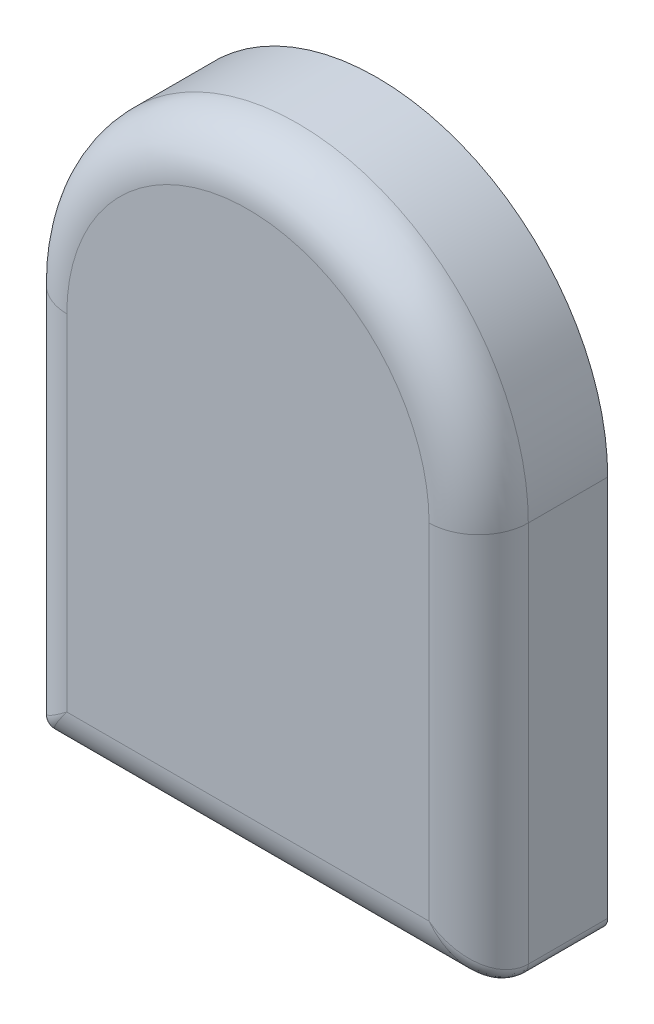
ISO-10303-21;
HEADER;
FILE_DESCRIPTION(('STEP AP214'),'2;1');
FILE_NAME('part.step','',(''),(''),'','','');
FILE_SCHEMA(('AUTOMOTIVE_DESIGN { 1 0 10303 214 1 1 1 1 }'));
ENDSEC;
DATA;
#1=APPLICATION_CONTEXT('core data for automotive mechanical design processes');
#2=APPLICATION_PROTOCOL_DEFINITION('international standard','automotive_design',2000,#1);
#3=PRODUCT_CONTEXT('',#1,'mechanical');
#4=PRODUCT('Part','Part','',(#3));
#5=PRODUCT_RELATED_PRODUCT_CATEGORY('part','',(#4));
#6=PRODUCT_DEFINITION_FORMATION('','',#4);
#7=PRODUCT_DEFINITION_CONTEXT('part definition',#1,'design');
#8=PRODUCT_DEFINITION('design','',#6,#7);
#9=PRODUCT_DEFINITION_SHAPE('','',#8);
#10=(LENGTH_UNIT() NAMED_UNIT(*) SI_UNIT(.MILLI.,.METRE.));
#11=(NAMED_UNIT(*) PLANE_ANGLE_UNIT() SI_UNIT($,.RADIAN.));
#12=(NAMED_UNIT(*) SI_UNIT($,.STERADIAN.) SOLID_ANGLE_UNIT());
#13=UNCERTAINTY_MEASURE_WITH_UNIT(LENGTH_MEASURE(1.E-05),#10,'distance_accuracy_value','');
#14=(GEOMETRIC_REPRESENTATION_CONTEXT(3) GLOBAL_UNCERTAINTY_ASSIGNED_CONTEXT((#13)) GLOBAL_UNIT_ASSIGNED_CONTEXT((#10,
#11,#12)) REPRESENTATION_CONTEXT('',''));
#15=CARTESIAN_POINT('',(0.,0.,0.));
#16=DIRECTION('',(0.,0.,1.));
#17=DIRECTION('',(1.,0.,0.));
#18=AXIS2_PLACEMENT_3D('',#15,#16,#17);
#19=CARTESIAN_POINT('',(8.8,-12.1,5.2));
#20=DIRECTION('',(0.,0.,-1.));
#21=DIRECTION('',(-1.,0.,0.));
#22=AXIS2_PLACEMENT_3D('',#19,#20,#21);
#23=CYLINDRICAL_SURFACE('',#22,0.5);
#24=DIRECTION('',(0.,0.,-1.));
#25=VECTOR('',#24,1.);
#26=CARTESIAN_POINT('',(9.3,-12.1,5.2));
#27=LINE('',#26,#25);
#28=CARTESIAN_POINT('',(9.3,-12.1,3.2));
#29=VERTEX_POINT('',#28);
#30=CARTESIAN_POINT('',(9.3,-12.1,0.));
#31=VERTEX_POINT('',#30);
#32=EDGE_CURVE('E109',#29,#31,#27,.T.);
#33=ORIENTED_EDGE('',*,*,#32,.F.);
#34=CARTESIAN_POINT('',(8.8,-12.1,3.2));
#35=DIRECTION('',(0.,0.,-1.));
#36=DIRECTION('',(-1.,0.,0.));
#37=AXIS2_PLACEMENT_3D('',#34,#35,#36);
#38=CIRCLE('',#37,0.5);
#39=CARTESIAN_POINT('',(8.8,-12.6,3.2));
#40=VERTEX_POINT('',#39);
#41=EDGE_CURVE('E185',#29,#40,#38,.T.);
#42=ORIENTED_EDGE('',*,*,#41,.T.);
#43=DIRECTION('',(0.,0.,-1.));
#44=VECTOR('',#43,1.);
#45=CARTESIAN_POINT('',(8.8,-12.6,5.2));
#46=LINE('',#45,#44);
#47=CARTESIAN_POINT('',(8.8,-12.6,0.));
#48=VERTEX_POINT('',#47);
#49=EDGE_CURVE('E135',#40,#48,#46,.T.);
#50=ORIENTED_EDGE('',*,*,#49,.T.);
#51=CARTESIAN_POINT('',(8.8,-12.1,0.));
#52=DIRECTION('',(0.,0.,1.));
#53=DIRECTION('',(1.,0.,0.));
#54=AXIS2_PLACEMENT_3D('',#51,#52,#53);
#55=CIRCLE('',#54,0.5);
#56=EDGE_CURVE('E128',#48,#31,#55,.T.);
#57=ORIENTED_EDGE('',*,*,#56,.T.);
#58=EDGE_LOOP('',(#33,#42,#50,#57));
#59=FACE_BOUND('',#58,.T.);
#60=ADVANCED_FACE('F43',(#59),#23,.T.);
#61=CARTESIAN_POINT('',(9.3,3.3,5.2));
#62=DIRECTION('',(-1.,0.,0.));
#63=DIRECTION('',(0.,0.,1.));
#64=AXIS2_PLACEMENT_3D('',#61,#62,#63);
#65=PLANE('',#64);
#66=DIRECTION('',(0.,0.,-1.));
#67=VECTOR('',#66,1.);
#68=CARTESIAN_POINT('',(9.3,3.3,5.2));
#69=LINE('',#68,#67);
#70=CARTESIAN_POINT('',(9.3,3.3,3.2));
#71=VERTEX_POINT('',#70);
#72=CARTESIAN_POINT('',(9.3,3.3,0.));
#73=VERTEX_POINT('',#72);
#74=EDGE_CURVE('E122',#71,#73,#69,.T.);
#75=ORIENTED_EDGE('',*,*,#74,.F.);
#76=DIRECTION('',(0.,1.,0.));
#77=VECTOR('',#76,1.);
#78=CARTESIAN_POINT('',(9.3,-12.1,3.2));
#79=LINE('',#78,#77);
#80=EDGE_CURVE('E116',#71,#29,#79,.F.);
#81=ORIENTED_EDGE('',*,*,#80,.T.);
#82=ORIENTED_EDGE('',*,*,#32,.T.);
#83=DIRECTION('',(0.,1.,0.));
#84=VECTOR('',#83,1.);
#85=CARTESIAN_POINT('',(9.3,3.3,0.));
#86=LINE('',#85,#84);
#87=EDGE_CURVE('E113',#31,#73,#86,.T.);
#88=ORIENTED_EDGE('',*,*,#87,.T.);
#89=EDGE_LOOP('',(#75,#81,#82,#88));
#90=FACE_BOUND('',#89,.T.);
#91=ADVANCED_FACE('F112',(#90),#65,.F.);
#92=CARTESIAN_POINT('',(0.,3.3,5.2));
#93=DIRECTION('',(0.,0.,-1.));
#94=DIRECTION('',(-1.,0.,0.));
#95=AXIS2_PLACEMENT_3D('',#92,#93,#94);
#96=CYLINDRICAL_SURFACE('',#95,9.3);
#97=DIRECTION('',(0.,0.,-1.));
#98=VECTOR('',#97,1.);
#99=CARTESIAN_POINT('',(-9.3,3.3,5.2));
#100=LINE('',#99,#98);
#101=CARTESIAN_POINT('',(-9.3,3.3,3.2));
#102=VERTEX_POINT('',#101);
#103=CARTESIAN_POINT('',(-9.3,3.3,0.));
#104=VERTEX_POINT('',#103);
#105=EDGE_CURVE('E164',#102,#104,#100,.T.);
#106=ORIENTED_EDGE('',*,*,#105,.F.);
#107=CARTESIAN_POINT('',(0.,3.3,3.2));
#108=DIRECTION('',(0.,0.,1.));
#109=DIRECTION('',(1.,0.,0.));
#110=AXIS2_PLACEMENT_3D('',#107,#108,#109);
#111=CIRCLE('',#110,9.3);
#112=EDGE_CURVE('E190',#102,#71,#111,.F.);
#113=ORIENTED_EDGE('',*,*,#112,.T.);
#114=ORIENTED_EDGE('',*,*,#74,.T.);
#115=CARTESIAN_POINT('',(0.,3.3,0.));
#116=DIRECTION('',(0.,0.,1.));
#117=DIRECTION('',(1.,0.,0.));
#118=AXIS2_PLACEMENT_3D('',#115,#116,#117);
#119=CIRCLE('',#118,9.3);
#120=EDGE_CURVE('E131',#73,#104,#119,.T.);
#121=ORIENTED_EDGE('',*,*,#120,.T.);
#122=EDGE_LOOP('',(#106,#113,#114,#121));
#123=FACE_BOUND('',#122,.T.);
#124=ADVANCED_FACE('F249',(#123),#96,.T.);
#125=CARTESIAN_POINT('',(-9.3,-12.1,5.2));
#126=DIRECTION('',(1.,0.,0.));
#127=DIRECTION('',(0.,1.,0.));
#128=AXIS2_PLACEMENT_3D('',#125,#126,#127);
#129=PLANE('',#128);
#130=DIRECTION('',(0.,0.,-1.));
#131=VECTOR('',#130,1.);
#132=CARTESIAN_POINT('',(-9.3,-12.1,5.2));
#133=LINE('',#132,#131);
#134=CARTESIAN_POINT('',(-9.3,-12.1,3.2));
#135=VERTEX_POINT('',#134);
#136=CARTESIAN_POINT('',(-9.3,-12.1,0.));
#137=VERTEX_POINT('',#136);
#138=EDGE_CURVE('E161',#135,#137,#133,.T.);
#139=ORIENTED_EDGE('',*,*,#138,.F.);
#140=DIRECTION('',(0.,-1.,0.));
#141=VECTOR('',#140,1.);
#142=CARTESIAN_POINT('',(-9.3,3.3,3.2));
#143=LINE('',#142,#141);
#144=EDGE_CURVE('E53',#135,#102,#143,.F.);
#145=ORIENTED_EDGE('',*,*,#144,.T.);
#146=ORIENTED_EDGE('',*,*,#105,.T.);
#147=DIRECTION('',(0.,-1.,0.));
#148=VECTOR('',#147,1.);
#149=CARTESIAN_POINT('',(-9.3,-12.1,0.));
#150=LINE('',#149,#148);
#151=EDGE_CURVE('E145',#104,#137,#150,.T.);
#152=ORIENTED_EDGE('',*,*,#151,.T.);
#153=EDGE_LOOP('',(#139,#145,#146,#152));
#154=FACE_BOUND('',#153,.T.);
#155=ADVANCED_FACE('F250',(#154),#129,.F.);
#156=CARTESIAN_POINT('',(-8.8,-12.1,5.2));
#157=DIRECTION('',(0.,0.,-1.));
#158=DIRECTION('',(-1.,0.,0.));
#159=AXIS2_PLACEMENT_3D('',#156,#157,#158);
#160=CYLINDRICAL_SURFACE('',#159,0.5);
#161=DIRECTION('',(0.,0.,-1.));
#162=VECTOR('',#161,1.);
#163=CARTESIAN_POINT('',(-8.8,-12.6,5.2));
#164=LINE('',#163,#162);
#165=CARTESIAN_POINT('',(-8.8,-12.6,3.2));
#166=VERTEX_POINT('',#165);
#167=CARTESIAN_POINT('',(-8.8,-12.6,0.));
#168=VERTEX_POINT('',#167);
#169=EDGE_CURVE('E158',#166,#168,#164,.T.);
#170=ORIENTED_EDGE('',*,*,#169,.F.);
#171=CARTESIAN_POINT('',(-8.8,-12.1,3.2));
#172=DIRECTION('',(0.,0.,-1.));
#173=DIRECTION('',(-1.,0.,0.));
#174=AXIS2_PLACEMENT_3D('',#171,#172,#173);
#175=CIRCLE('',#174,0.5);
#176=EDGE_CURVE('E11',#166,#135,#175,.T.);
#177=ORIENTED_EDGE('',*,*,#176,.T.);
#178=ORIENTED_EDGE('',*,*,#138,.T.);
#179=CARTESIAN_POINT('',(-8.8,-12.1,0.));
#180=DIRECTION('',(0.,0.,1.));
#181=DIRECTION('',(1.,0.,0.));
#182=AXIS2_PLACEMENT_3D('',#179,#180,#181);
#183=CIRCLE('',#182,0.5);
#184=EDGE_CURVE('E149',#137,#168,#183,.T.);
#185=ORIENTED_EDGE('',*,*,#184,.T.);
#186=EDGE_LOOP('',(#170,#177,#178,#185));
#187=FACE_BOUND('',#186,.T.);
#188=ADVANCED_FACE('F252',(#187),#160,.T.);
#189=CARTESIAN_POINT('',(8.8,-12.6,5.2));
#190=DIRECTION('',(0.,1.,0.));
#191=DIRECTION('',(0.,0.,1.));
#192=AXIS2_PLACEMENT_3D('',#189,#190,#191);
#193=PLANE('',#192);
#194=ORIENTED_EDGE('',*,*,#49,.F.);
#195=DIRECTION('',(1.,0.,0.));
#196=VECTOR('',#195,1.);
#197=CARTESIAN_POINT('',(-8.8,-12.6,3.2));
#198=LINE('',#197,#196);
#199=EDGE_CURVE('E181',#40,#166,#198,.F.);
#200=ORIENTED_EDGE('',*,*,#199,.T.);
#201=ORIENTED_EDGE('',*,*,#169,.T.);
#202=DIRECTION('',(1.,0.,0.));
#203=VECTOR('',#202,1.);
#204=CARTESIAN_POINT('',(8.8,-12.6,0.));
#205=LINE('',#204,#203);
#206=EDGE_CURVE('E153',#168,#48,#205,.T.);
#207=ORIENTED_EDGE('',*,*,#206,.T.);
#208=EDGE_LOOP('',(#194,#200,#201,#207));
#209=FACE_BOUND('',#208,.T.);
#210=ADVANCED_FACE('F254',(#209),#193,.F.);
#211=CARTESIAN_POINT('',(8.8,-12.1,5.2));
#212=DIRECTION('',(0.,0.,1.));
#213=DIRECTION('',(1.,0.,0.));
#214=AXIS2_PLACEMENT_3D('',#211,#212,#213);
#215=PLANE('',#214);
#216=DIRECTION('',(0.,-1.,0.));
#217=VECTOR('',#216,1.);
#218=CARTESIAN_POINT('',(-7.3,-12.1,5.2));
#219=LINE('',#218,#217);
#220=CARTESIAN_POINT('',(-7.3,3.3,5.2));
#221=VERTEX_POINT('',#220);
#222=CARTESIAN_POINT('',(-7.3,-10.6,5.2));
#223=VERTEX_POINT('',#222);
#224=EDGE_CURVE('E121',#221,#223,#219,.T.);
#225=ORIENTED_EDGE('',*,*,#224,.T.);
#226=DIRECTION('',(1.,0.,0.));
#227=VECTOR('',#226,1.);
#228=CARTESIAN_POINT('',(8.8,-10.6,5.2));
#229=LINE('',#228,#227);
#230=CARTESIAN_POINT('',(7.3,-10.6,5.2));
#231=VERTEX_POINT('',#230);
#232=EDGE_CURVE('E177',#223,#231,#229,.T.);
#233=ORIENTED_EDGE('',*,*,#232,.T.);
#234=DIRECTION('',(0.,1.,0.));
#235=VECTOR('',#234,1.);
#236=CARTESIAN_POINT('',(7.3,3.3,5.2));
#237=LINE('',#236,#235);
#238=CARTESIAN_POINT('',(7.3,3.3,5.2));
#239=VERTEX_POINT('',#238);
#240=EDGE_CURVE('E174',#231,#239,#237,.T.);
#241=ORIENTED_EDGE('',*,*,#240,.T.);
#242=CARTESIAN_POINT('',(0.,3.3,5.2));
#243=DIRECTION('',(0.,0.,1.));
#244=DIRECTION('',(1.,0.,0.));
#245=AXIS2_PLACEMENT_3D('',#242,#243,#244);
#246=CIRCLE('',#245,7.3);
#247=EDGE_CURVE('E171',#239,#221,#246,.T.);
#248=ORIENTED_EDGE('',*,*,#247,.T.);
#249=EDGE_LOOP('',(#225,#233,#241,#248));
#250=FACE_BOUND('',#249,.T.);
#251=ADVANCED_FACE('F260',(#250),#215,.T.);
#252=CARTESIAN_POINT('',(8.8,-12.1,0.));
#253=DIRECTION('',(0.,0.,1.));
#254=DIRECTION('',(1.,0.,0.));
#255=AXIS2_PLACEMENT_3D('',#252,#253,#254);
#256=PLANE('',#255);
#257=ORIENTED_EDGE('',*,*,#56,.F.);
#258=ORIENTED_EDGE('',*,*,#206,.F.);
#259=ORIENTED_EDGE('',*,*,#184,.F.);
#260=ORIENTED_EDGE('',*,*,#151,.F.);
#261=ORIENTED_EDGE('',*,*,#120,.F.);
#262=ORIENTED_EDGE('',*,*,#87,.F.);
#263=EDGE_LOOP('',(#257,#258,#259,#260,#261,#262));
#264=FACE_BOUND('',#263,.T.);
#265=ADVANCED_FACE('F126',(#264),#256,.F.);
#266=CARTESIAN_POINT('',(0.,3.3,3.2));
#267=DIRECTION('',(0.,0.,1.));
#268=DIRECTION('',(1.,0.,0.));
#269=AXIS2_PLACEMENT_3D('',#266,#267,#268);
#270=TOROIDAL_SURFACE('',#269,7.3,2.);
#271=CARTESIAN_POINT('',(7.3,3.3,3.2));
#272=DIRECTION('',(0.,-1.,0.));
#273=DIRECTION('',(0.,0.,-1.));
#274=AXIS2_PLACEMENT_3D('',#271,#272,#273);
#275=CIRCLE('',#274,2.);
#276=EDGE_CURVE('E141',#71,#239,#275,.T.);
#277=ORIENTED_EDGE('',*,*,#276,.F.);
#278=ORIENTED_EDGE('',*,*,#112,.F.);
#279=CARTESIAN_POINT('',(-7.3,3.3,3.2));
#280=DIRECTION('',(0.,-1.,0.));
#281=DIRECTION('',(1.,0.,0.));
#282=AXIS2_PLACEMENT_3D('',#279,#280,#281);
#283=CIRCLE('',#282,2.);
#284=EDGE_CURVE('E47',#221,#102,#283,.T.);
#285=ORIENTED_EDGE('',*,*,#284,.F.);
#286=ORIENTED_EDGE('',*,*,#247,.F.);
#287=EDGE_LOOP('',(#277,#278,#285,#286));
#288=FACE_BOUND('',#287,.T.);
#289=ADVANCED_FACE('F45',(#288),#270,.T.);
#290=CARTESIAN_POINT('',(-7.3,-12.1,3.2));
#291=DIRECTION('',(0.,1.,0.));
#292=DIRECTION('',(-1.,0.,0.));
#293=AXIS2_PLACEMENT_3D('',#290,#291,#292);
#294=CYLINDRICAL_SURFACE('',#293,2.);
#295=ORIENTED_EDGE('',*,*,#284,.T.);
#296=ORIENTED_EDGE('',*,*,#144,.F.);
#297=CARTESIAN_POINT('',(-7.3,-10.6,3.2));
#298=DIRECTION('',(0.6,-0.8,0.));
#299=DIRECTION('',(-0.8,-0.6,0.));
#300=AXIS2_PLACEMENT_3D('',#297,#298,#299);
#301=ELLIPSE('',#300,2.5,2.);
#302=EDGE_CURVE('E205',#223,#135,#301,.T.);
#303=ORIENTED_EDGE('',*,*,#302,.F.);
#304=ORIENTED_EDGE('',*,*,#224,.F.);
#305=EDGE_LOOP('',(#295,#296,#303,#304));
#306=FACE_BOUND('',#305,.T.);
#307=ADVANCED_FACE('F225',(#306),#294,.T.);
#308=CARTESIAN_POINT('',(7.3,-12.1,3.2));
#309=DIRECTION('',(0.,-1.,0.));
#310=DIRECTION('',(0.,0.,-1.));
#311=AXIS2_PLACEMENT_3D('',#308,#309,#310);
#312=CYLINDRICAL_SURFACE('',#311,2.);
#313=ORIENTED_EDGE('',*,*,#276,.T.);
#314=ORIENTED_EDGE('',*,*,#240,.F.);
#315=CARTESIAN_POINT('',(7.3,-10.6,3.2));
#316=DIRECTION('',(0.6,0.8,0.));
#317=DIRECTION('',(0.8,-0.6,0.));
#318=AXIS2_PLACEMENT_3D('',#315,#316,#317);
#319=ELLIPSE('',#318,2.5,2.);
#320=EDGE_CURVE('E201',#29,#231,#319,.F.);
#321=ORIENTED_EDGE('',*,*,#320,.F.);
#322=ORIENTED_EDGE('',*,*,#80,.F.);
#323=EDGE_LOOP('',(#313,#314,#321,#322));
#324=FACE_BOUND('',#323,.T.);
#325=ADVANCED_FACE('F221',(#324),#312,.T.);
#326=CARTESIAN_POINT('',(-7.3,-10.6,1.2));
#327=CARTESIAN_POINT('',(-7.3,-10.6,1.2));
#328=CARTESIAN_POINT('',(-7.3,-10.6,1.2));
#329=CARTESIAN_POINT('',(-7.36534712065569,-10.6871294942076,1.20003505525001));
#330=CARTESIAN_POINT('',(-7.37625301968526,-10.6762530196853,1.1999763390959));
#331=CARTESIAN_POINT('',(-7.38712949420759,-10.6653471206557,1.20003505525001));
#332=CARTESIAN_POINT('',(-7.43071092668624,-10.7742812355817,1.20569648743083));
#333=CARTESIAN_POINT('',(-7.45271669848803,-10.752716698488,1.20427736082193));
#334=CARTESIAN_POINT('',(-7.47428123558166,-10.7307109266862,1.20569648743083));
#335=CARTESIAN_POINT('',(-7.56031449090428,-10.9470859878724,1.2284270510889));
#336=CARTESIAN_POINT('',(-7.60446975212246,-10.9044697521225,1.22140059823371));
#337=CARTESIAN_POINT('',(-7.64708598787237,-10.8603144909043,1.2284270510889));
#338=CARTESIAN_POINT('',(-7.62455908096206,-11.0327454412827,1.24539880932181));
#339=CARTESIAN_POINT('',(-7.68019165762918,-10.9801916576292,1.23424702570518));
#340=CARTESIAN_POINT('',(-7.73274544128274,-10.9245590809621,1.24539880932181));
#341=CARTESIAN_POINT('',(-7.75083012894728,-11.2011068385964,1.29051630855629));
#342=CARTESIAN_POINT('',(-7.82973753195478,-11.1297375319548,1.26847952163033));
#343=CARTESIAN_POINT('',(-7.90110683859638,-11.0508301289473,1.29051630855629));
#344=CARTESIAN_POINT('',(-7.81287571744484,-11.2838342899265,1.31846985415551));
#345=CARTESIAN_POINT('',(-7.90398851452828,-11.2039885145283,1.2899128957497));
#346=CARTESIAN_POINT('',(-7.98383428992645,-11.1128757174448,1.31846985415551));
#347=CARTESIAN_POINT('',(-7.93366820048003,-11.4448909339734,1.38518008569313));
#348=CARTESIAN_POINT('',(-8.04991425185414,-11.3499142518541,1.34136060699245));
#349=CARTESIAN_POINT('',(-8.14489093397337,-11.23366820048,1.38518008569313));
#350=CARTESIAN_POINT('',(-7.99245870376998,-11.5232782716933,1.42365367911435));
#351=CARTESIAN_POINT('',(-8.12200143121126,-11.4220014312113,1.37144196647632));
#352=CARTESIAN_POINT('',(-8.22327827169331,-11.29245870377,1.42365367911435));
#353=CARTESIAN_POINT('',(-8.10570975300993,-11.6742796706799,1.51083477666372));
#354=CARTESIAN_POINT('',(-8.26295325731846,-11.5629532573185,1.44036706240652));
#355=CARTESIAN_POINT('',(-8.3742796706799,-11.4057097530099,1.51083477666372));
#356=CARTESIAN_POINT('',(-8.1602485580067,-11.7469980773423,1.55917755510622));
#357=CARTESIAN_POINT('',(-8.33220337416109,-11.6322033741611,1.4792889175249));
#358=CARTESIAN_POINT('',(-8.44699807734226,-11.4602485580067,1.55917755510622));
#359=CARTESIAN_POINT('',(-8.26402611496821,-11.8853681532909,1.66535303478994));
#360=CARTESIAN_POINT('',(-8.46682192510474,-11.7668219251047,1.56629785668495));
#361=CARTESIAN_POINT('',(-8.58536815329094,-11.5640261149682,1.66535303478995));
#362=CARTESIAN_POINT('',(-8.31338750743845,-11.9511833432513,1.72275539715579));
#363=CARTESIAN_POINT('',(-8.53252990498461,-11.8325299049846,1.61445568037617));
#364=CARTESIAN_POINT('',(-8.65118334325127,-11.6133875074385,1.72275539715579));
#365=CARTESIAN_POINT('',(-8.40591892041319,-12.0745585605509,1.84613222216279));
#366=CARTESIAN_POINT('',(-8.65927843911775,-11.9592784391177,1.72064706325371));
#367=CARTESIAN_POINT('',(-8.77455856055092,-11.7059189204132,1.84613222216279));
#368=CARTESIAN_POINT('',(-8.44926311849199,-12.132350824656,1.91163731328287));
#369=CARTESIAN_POINT('',(-8.72058796060971,-12.0205879606097,1.77870927589382));
#370=CARTESIAN_POINT('',(-8.83235082465598,-11.749263118492,1.91163731328287));
#371=CARTESIAN_POINT('',(-8.52896450999682,-12.2386193466624,2.05013285836795));
#372=CARTESIAN_POINT('',(-8.83742230607737,-12.1374223060774,1.90571865584249));
#373=CARTESIAN_POINT('',(-8.93861934666242,-11.8289645099968,2.05013285836795));
#374=CARTESIAN_POINT('',(-8.56554818620167,-12.2873975816022,2.12265451812362));
#375=CARTESIAN_POINT('',(-8.893119014594,-12.193119014594,1.97459478240419));
#376=CARTESIAN_POINT('',(-8.98739758160223,-11.8655481862017,2.12265451812362));
#377=CARTESIAN_POINT('',(-8.63104897214961,-12.3747319628661,2.27392958631864));
#378=CARTESIAN_POINT('',(-8.99700237456934,-12.2970023745693,2.12428825163707));
#379=CARTESIAN_POINT('',(-9.07473196286614,-11.9310489721496,2.27392958631864));
#380=CARTESIAN_POINT('',(-8.66023331373321,-12.4136444183109,2.35226632370846));
#381=CARTESIAN_POINT('',(-9.04524564728287,-12.3452456472829,2.20485256451251));
#382=CARTESIAN_POINT('',(-9.11364441831094,-11.9602333137332,2.35226632370846));
#383=CARTESIAN_POINT('',(-8.71039789563343,-12.4805305275112,2.51375694675793));
#384=CARTESIAN_POINT('',(-9.13168487740083,-12.4316848774008,2.37835057694996));
#385=CARTESIAN_POINT('',(-9.18053052751125,-12.0103978956334,2.51375694675793));
#386=CARTESIAN_POINT('',(-8.73165591145982,-12.5088745486131,2.59659973042092));
#387=CARTESIAN_POINT('',(-9.16982930810949,-12.4698293081095,2.47075659896622));
#388=CARTESIAN_POINT('',(-9.20887454861309,-12.0316559114598,2.59659973042092));
#389=CARTESIAN_POINT('',(-8.76560412617006,-12.5541388348934,2.76554895244281));
#390=CARTESIAN_POINT('',(-9.23291592445389,-12.5329159244539,2.6666663568643));
#391=CARTESIAN_POINT('',(-9.25413883489341,-12.0656041261701,2.76554895244281));
#392=CARTESIAN_POINT('',(-8.7785324204649,-12.5713765606199,2.85148270452044));
#393=CARTESIAN_POINT('',(-9.25774658379329,-12.5577465837933,2.76930869505542));
#394=CARTESIAN_POINT('',(-9.27137656061987,-12.0785324204649,2.85148270452044));
#395=CARTESIAN_POINT('',(-8.79566049473916,-12.5942139929855,3.02497752445519));
#396=CARTESIAN_POINT('',(-9.29133353940984,-12.5913335394098,2.98185786072974));
#397=CARTESIAN_POINT('',(-9.29421399298555,-12.0956604947392,3.02497752445519));
#398=CARTESIAN_POINT('',(-8.8,-12.6,3.1124887622276));
#399=CARTESIAN_POINT('',(-9.3,-12.6,3.09061065054439));
#400=CARTESIAN_POINT('',(-9.3,-12.1,3.1124887622276));
#401=CARTESIAN_POINT('',(-8.8,-12.6,3.2875112377724));
#402=CARTESIAN_POINT('',(-9.3,-12.6,3.3093893494556));
#403=CARTESIAN_POINT('',(-9.3,-12.1,3.2875112377724));
#404=CARTESIAN_POINT('',(-8.79566049473916,-12.5942139929855,3.37502247554481));
#405=CARTESIAN_POINT('',(-9.29133353940984,-12.5913335394098,3.41814213927026));
#406=CARTESIAN_POINT('',(-9.29421399298555,-12.0956604947392,3.37502247554481));
#407=CARTESIAN_POINT('',(-8.7785324204649,-12.5713765606199,3.54851729547956));
#408=CARTESIAN_POINT('',(-9.25774658379329,-12.5577465837933,3.63069130494458));
#409=CARTESIAN_POINT('',(-9.27137656061987,-12.0785324204649,3.54851729547956));
#410=CARTESIAN_POINT('',(-8.76560412617006,-12.5541388348934,3.63445104755719));
#411=CARTESIAN_POINT('',(-9.23291592445389,-12.5329159244539,3.7333336431357));
#412=CARTESIAN_POINT('',(-9.25413883489341,-12.0656041261701,3.63445104755719));
#413=CARTESIAN_POINT('',(-8.73165591145982,-12.5088745486131,3.80340026957908));
#414=CARTESIAN_POINT('',(-9.16982930810949,-12.4698293081095,3.92924340103378));
#415=CARTESIAN_POINT('',(-9.20887454861309,-12.0316559114598,3.80340026957908));
#416=CARTESIAN_POINT('',(-8.71039789563343,-12.4805305275113,3.88624305324207));
#417=CARTESIAN_POINT('',(-9.13168487740082,-12.4316848774008,4.02164942305004));
#418=CARTESIAN_POINT('',(-9.18053052751125,-12.0103978956334,3.88624305324207));
#419=CARTESIAN_POINT('',(-8.66023331373321,-12.4136444183109,4.04773367629154));
#420=CARTESIAN_POINT('',(-9.04524564728287,-12.3452456472829,4.19514743548749));
#421=CARTESIAN_POINT('',(-9.11364441831094,-11.9602333137332,4.04773367629154));
#422=CARTESIAN_POINT('',(-8.63104897214961,-12.3747319628661,4.12607041368136));
#423=CARTESIAN_POINT('',(-8.99700237456934,-12.2970023745693,4.27571174836293));
#424=CARTESIAN_POINT('',(-9.07473196286614,-11.9310489721496,4.12607041368136));
#425=CARTESIAN_POINT('',(-8.56554818620167,-12.2873975816022,4.27734548187638));
#426=CARTESIAN_POINT('',(-8.893119014594,-12.193119014594,4.42540521759581));
#427=CARTESIAN_POINT('',(-8.98739758160222,-11.8655481862017,4.27734548187638));
#428=CARTESIAN_POINT('',(-8.52896450999682,-12.2386193466624,4.34986714163204));
#429=CARTESIAN_POINT('',(-8.83742230607737,-12.1374223060774,4.49428134415751));
#430=CARTESIAN_POINT('',(-8.93861934666242,-11.8289645099968,4.34986714163204));
#431=CARTESIAN_POINT('',(-8.44926311849199,-12.132350824656,4.48836268671713));
#432=CARTESIAN_POINT('',(-8.72058796060972,-12.0205879606097,4.62129072410618));
#433=CARTESIAN_POINT('',(-8.83235082465598,-11.749263118492,4.48836268671713));
#434=CARTESIAN_POINT('',(-8.40591892041319,-12.0745585605509,4.55386777783721));
#435=CARTESIAN_POINT('',(-8.65927843911775,-11.9592784391177,4.67935293674629));
#436=CARTESIAN_POINT('',(-8.77455856055092,-11.7059189204132,4.55386777783721));
#437=CARTESIAN_POINT('',(-8.31338750743845,-11.9511833432513,4.67724460284421));
#438=CARTESIAN_POINT('',(-8.53252990498461,-11.8325299049846,4.78554431962383));
#439=CARTESIAN_POINT('',(-8.65118334325127,-11.6133875074385,4.67724460284421));
#440=CARTESIAN_POINT('',(-8.26402611496821,-11.8853681532909,4.73464696521005));
#441=CARTESIAN_POINT('',(-8.46682192510474,-11.7668219251047,4.83370214331504));
#442=CARTESIAN_POINT('',(-8.58536815329094,-11.5640261149682,4.73464696521005));
#443=CARTESIAN_POINT('',(-8.1602485580067,-11.7469980773423,4.84082244489378));
#444=CARTESIAN_POINT('',(-8.33220337416109,-11.6322033741611,4.9207110824751));
#445=CARTESIAN_POINT('',(-8.44699807734226,-11.4602485580067,4.84082244489378));
#446=CARTESIAN_POINT('',(-8.10570975300993,-11.6742796706799,4.88916522333628));
#447=CARTESIAN_POINT('',(-8.26295325731846,-11.5629532573185,4.95963293759348));
#448=CARTESIAN_POINT('',(-8.3742796706799,-11.4057097530099,4.88916522333628));
#449=CARTESIAN_POINT('',(-7.99245870376998,-11.5232782716933,4.97634632088565));
#450=CARTESIAN_POINT('',(-8.12200143121126,-11.4220014312113,5.02855803352368));
#451=CARTESIAN_POINT('',(-8.22327827169331,-11.29245870377,4.97634632088565));
#452=CARTESIAN_POINT('',(-7.93366820048003,-11.4448909339734,5.01481991430687));
#453=CARTESIAN_POINT('',(-8.04991425185414,-11.3499142518541,5.05863939300754));
#454=CARTESIAN_POINT('',(-8.14489093397337,-11.23366820048,5.01481991430687));
#455=CARTESIAN_POINT('',(-7.81287571744484,-11.2838342899265,5.08153014584449));
#456=CARTESIAN_POINT('',(-7.90398851452829,-11.2039885145283,5.1100871042503));
#457=CARTESIAN_POINT('',(-7.98383428992646,-11.1128757174448,5.08153014584449));
#458=CARTESIAN_POINT('',(-7.75083012894728,-11.2011068385964,5.10948369144371));
#459=CARTESIAN_POINT('',(-7.82973753195478,-11.1297375319548,5.13152047836967));
#460=CARTESIAN_POINT('',(-7.90110683859638,-11.0508301289473,5.10948369144371));
#461=CARTESIAN_POINT('',(-7.62455908096206,-11.0327454412827,5.15460119067819));
#462=CARTESIAN_POINT('',(-7.68019165762918,-10.9801916576292,5.16575297429482));
#463=CARTESIAN_POINT('',(-7.73274544128274,-10.9245590809621,5.15460119067819));
#464=CARTESIAN_POINT('',(-7.56031449090428,-10.9470859878724,5.1715729489111));
#465=CARTESIAN_POINT('',(-7.60446975212246,-10.9044697521225,5.17859940176629));
#466=CARTESIAN_POINT('',(-7.64708598787237,-10.8603144909043,5.1715729489111));
#467=CARTESIAN_POINT('',(-7.43071092668624,-10.7742812355817,5.19430351256917));
#468=CARTESIAN_POINT('',(-7.45271669848803,-10.752716698488,5.19572263917807));
#469=CARTESIAN_POINT('',(-7.47428123558166,-10.7307109266862,5.19430351256917));
#470=CARTESIAN_POINT('',(-7.3653471206557,-10.6871294942076,5.19996494474999));
#471=CARTESIAN_POINT('',(-7.37625301968526,-10.6762530196853,5.2000236609041));
#472=CARTESIAN_POINT('',(-7.38712949420759,-10.6653471206557,5.19996494474999));
#473=CARTESIAN_POINT('',(-7.3,-10.6,5.2));
#474=CARTESIAN_POINT('',(-7.3,-10.6,5.2));
#475=CARTESIAN_POINT('',(-7.3,-10.6,5.2));
#476=(BOUNDED_SURFACE() B_SPLINE_SURFACE(3,2,((#326,#327,#328),(#329,#330,#331),(#332,#333,
#334),(#335,#336,#337),(#338,#339,#340),(#341,#342,#343),(#344,#345,#346),(#347,#348,#349),
(#350,#351,#352),(#353,#354,#355),(#356,#357,#358),(#359,#360,#361),(#362,#363,#364),(#365,#366,
#367),(#368,#369,#370),(#371,#372,#373),(#374,#375,#376),(#377,#378,#379),(#380,#381,#382),
(#383,#384,#385),(#386,#387,#388),(#389,#390,#391),(#392,#393,#394),(#395,#396,#397),(#398,#399,
#400),(#401,#402,#403),(#404,#405,#406),(#407,#408,#409),(#410,#411,#412),(#413,#414,#415),
(#416,#417,#418),(#419,#420,#421),(#422,#423,#424),(#425,#426,#427),(#428,#429,#430),(#431,#432,
#433),(#434,#435,#436),(#437,#438,#439),(#440,#441,#442),(#443,#444,#445),(#446,#447,#448),
(#449,#450,#451),(#452,#453,#454),(#455,#456,#457),(#458,#459,#460),(#461,#462,#463),(#464,#465,
#466),(#467,#468,#469),(#470,#471,#472),(#473,#474,#475)),.UNSPECIFIED.,.F.,.F.,
.F.) B_SPLINE_SURFACE_WITH_KNOTS((4,2,2,2,2,2,2,2,2,2,2,2,2,2,2,2,2,2,2,2,2,2,2,2,4),(3,3),(0.,
0.277185081205051,0.552014119053092,0.822233461976019,1.08579611517548,1.34096955189626,
1.58644804888033,1.82146864153553,2.04592551633704,2.26046944958155,2.4665662185127,
2.66647462606246,2.86310321556792,3.05973180507339,3.25964021262314,3.46573698155429,
3.6802809147988,3.90473778960032,4.13975838225551,4.38523687923959,4.64041031596037,
4.90397296915983,5.17419231208275,5.44902134993079,5.72620643113585),(0.,1.),
.UNSPECIFIED.) GEOMETRIC_REPRESENTATION_ITEM() RATIONAL_B_SPLINE_SURFACE(((1.,1.,1.),(1.,
1.00000566557019,1.),(1.,0.998576699090688,1.),(1.,0.992910721279765,1.),(1.,0.988697681267574,
1.),(1.,0.97761712883305,1.),(1.,0.970795325018433,1.),(1.,0.954789124900482,1.),(1.,
0.945667069465631,1.),(1.,0.92548796875733,1.),(1.,0.914501756375306,1.),(1.,0.891169998194024,
1.),(1.,0.878891956959708,1.),(1.,0.853706993048538,1.),(1.,0.84084914596985,1.),(1.,
0.815387454422431,1.),(1.,0.802798170091792,1.),(1.,0.778880732263429,1.),(1.,0.767521437046521,
1.),(1.,0.747118526989836,1.),(1.,0.738001346912332,1.),(1.,0.723039691293395,1.),(1.,
0.717105167896984,1.),(1.,0.709170186451793,1.),(1.,0.707106781186548,1.),(1.,0.707106781186548,
1.),(1.,0.709170186451793,1.),(1.,0.717105167896984,1.),(1.,0.723039691293395,1.),(1.,
0.738001346912332,1.),(1.,0.747118526989836,1.),(1.,0.767521437046521,1.),(1.,0.778880732263429,
1.),(1.,0.802798170091792,1.),(1.,0.815387454422431,1.),(1.,0.84084914596985,1.),(1.,
0.853706993048538,1.),(1.,0.878891956959708,1.),(1.,0.891169998194024,1.),(1.,0.914501756375306,
1.),(1.,0.92548796875733,1.),(1.,0.945667069465631,1.),(1.,0.954789124900482,1.),(1.,
0.970795325018433,1.),(1.,0.97761712883305,1.),(1.,0.988697681267574,1.),(1.,0.992910721279765,
1.),(1.,0.998576699090688,1.),(1.,1.00000566557019,1.),(1.,1.,1.))) REPRESENTATION_ITEM('') SURFACE());
#477=ORIENTED_EDGE('',*,*,#302,.T.);
#478=ORIENTED_EDGE('',*,*,#176,.F.);
#479=CARTESIAN_POINT('',(-7.3,-10.6,3.2));
#480=DIRECTION('',(0.8,-0.6,0.));
#481=DIRECTION('',(-0.6,-0.8,0.));
#482=AXIS2_PLACEMENT_3D('',#479,#480,#481);
#483=ELLIPSE('',#482,2.5,2.);
#484=EDGE_CURVE('E198',#223,#166,#483,.T.);
#485=ORIENTED_EDGE('',*,*,#484,.F.);
#486=EDGE_LOOP('',(#477,#478,#485));
#487=FACE_BOUND('',#486,.T.);
#488=ADVANCED_FACE('F217',(#487),#476,.T.);
#489=CARTESIAN_POINT('',(7.3,-10.6,1.2));
#490=CARTESIAN_POINT('',(7.3,-10.6,1.2));
#491=CARTESIAN_POINT('',(7.3,-10.6,1.2));
#492=CARTESIAN_POINT('',(7.38712949420759,-10.6653471206557,1.20003505525001));
#493=CARTESIAN_POINT('',(7.37625301968526,-10.6762530196853,1.1999763390959));
#494=CARTESIAN_POINT('',(7.3653471206557,-10.6871294942076,1.20003505525001));
#495=CARTESIAN_POINT('',(7.47428123558166,-10.7307109266862,1.20569648743083));
#496=CARTESIAN_POINT('',(7.45271669848803,-10.752716698488,1.20427736082193));
#497=CARTESIAN_POINT('',(7.43071092668625,-10.7742812355817,1.20569648743083));
#498=CARTESIAN_POINT('',(7.64708598787237,-10.8603144909043,1.2284270510889));
#499=CARTESIAN_POINT('',(7.60446975212246,-10.9044697521225,1.22140059823371));
#500=CARTESIAN_POINT('',(7.56031449090428,-10.9470859878724,1.2284270510889));
#501=CARTESIAN_POINT('',(7.73274544128274,-10.9245590809621,1.24539880932181));
#502=CARTESIAN_POINT('',(7.68019165762918,-10.9801916576292,1.23424702570518));
#503=CARTESIAN_POINT('',(7.62455908096206,-11.0327454412827,1.24539880932181));
#504=CARTESIAN_POINT('',(7.90110683859638,-11.0508301289473,1.29051630855629));
#505=CARTESIAN_POINT('',(7.82973753195478,-11.1297375319548,1.26847952163033));
#506=CARTESIAN_POINT('',(7.75083012894728,-11.2011068385964,1.29051630855629));
#507=CARTESIAN_POINT('',(7.98383428992646,-11.1128757174448,1.31846985415551));
#508=CARTESIAN_POINT('',(7.90398851452829,-11.2039885145283,1.2899128957497));
#509=CARTESIAN_POINT('',(7.81287571744484,-11.2838342899265,1.31846985415551));
#510=CARTESIAN_POINT('',(8.14489093397337,-11.23366820048,1.38518008569313));
#511=CARTESIAN_POINT('',(8.04991425185414,-11.3499142518541,1.34136060699246));
#512=CARTESIAN_POINT('',(7.93366820048003,-11.4448909339734,1.38518008569313));
#513=CARTESIAN_POINT('',(8.22327827169331,-11.29245870377,1.42365367911435));
#514=CARTESIAN_POINT('',(8.12200143121127,-11.4220014312113,1.37144196647632));
#515=CARTESIAN_POINT('',(7.99245870376998,-11.5232782716933,1.42365367911435));
#516=CARTESIAN_POINT('',(8.3742796706799,-11.4057097530099,1.51083477666372));
#517=CARTESIAN_POINT('',(8.26295325731846,-11.5629532573185,1.44036706240652));
#518=CARTESIAN_POINT('',(8.10570975300993,-11.6742796706799,1.51083477666372));
#519=CARTESIAN_POINT('',(8.44699807734226,-11.4602485580067,1.55917755510622));
#520=CARTESIAN_POINT('',(8.33220337416109,-11.6322033741611,1.4792889175249));
#521=CARTESIAN_POINT('',(8.1602485580067,-11.7469980773423,1.55917755510622));
#522=CARTESIAN_POINT('',(8.58536815329094,-11.5640261149682,1.66535303478994));
#523=CARTESIAN_POINT('',(8.46682192510474,-11.7668219251047,1.56629785668495));
#524=CARTESIAN_POINT('',(8.26402611496821,-11.8853681532909,1.66535303478994));
#525=CARTESIAN_POINT('',(8.65118334325127,-11.6133875074385,1.72275539715579));
#526=CARTESIAN_POINT('',(8.53252990498462,-11.8325299049846,1.61445568037617));
#527=CARTESIAN_POINT('',(8.31338750743845,-11.9511833432513,1.72275539715579));
#528=CARTESIAN_POINT('',(8.77455856055092,-11.7059189204132,1.84613222216279));
#529=CARTESIAN_POINT('',(8.65927843911775,-11.9592784391177,1.72064706325371));
#530=CARTESIAN_POINT('',(8.40591892041319,-12.0745585605509,1.84613222216279));
#531=CARTESIAN_POINT('',(8.83235082465598,-11.749263118492,1.91163731328287));
#532=CARTESIAN_POINT('',(8.72058796060971,-12.0205879606097,1.77870927589382));
#533=CARTESIAN_POINT('',(8.44926311849199,-12.132350824656,1.91163731328287));
#534=CARTESIAN_POINT('',(8.93861934666242,-11.8289645099968,2.05013285836795));
#535=CARTESIAN_POINT('',(8.83742230607737,-12.1374223060774,1.90571865584249));
#536=CARTESIAN_POINT('',(8.52896450999682,-12.2386193466624,2.05013285836795));
#537=CARTESIAN_POINT('',(8.98739758160223,-11.8655481862017,2.12265451812362));
#538=CARTESIAN_POINT('',(8.893119014594,-12.193119014594,1.97459478240419));
#539=CARTESIAN_POINT('',(8.56554818620167,-12.2873975816022,2.12265451812362));
#540=CARTESIAN_POINT('',(9.07473196286614,-11.9310489721496,2.27392958631864));
#541=CARTESIAN_POINT('',(8.99700237456934,-12.2970023745693,2.12428825163707));
#542=CARTESIAN_POINT('',(8.63104897214961,-12.3747319628661,2.27392958631864));
#543=CARTESIAN_POINT('',(9.11364441831095,-11.9602333137332,2.35226632370846));
#544=CARTESIAN_POINT('',(9.04524564728287,-12.3452456472829,2.20485256451251));
#545=CARTESIAN_POINT('',(8.66023331373321,-12.4136444183109,2.35226632370846));
#546=CARTESIAN_POINT('',(9.18053052751125,-12.0103978956334,2.51375694675793));
#547=CARTESIAN_POINT('',(9.13168487740083,-12.4316848774008,2.37835057694996));
#548=CARTESIAN_POINT('',(8.71039789563344,-12.4805305275112,2.51375694675793));
#549=CARTESIAN_POINT('',(9.2088745486131,-12.0316559114598,2.59659973042092));
#550=CARTESIAN_POINT('',(9.16982930810949,-12.4698293081095,2.47075659896622));
#551=CARTESIAN_POINT('',(8.73165591145982,-12.5088745486131,2.59659973042092));
#552=CARTESIAN_POINT('',(9.25413883489341,-12.0656041261701,2.76554895244281));
#553=CARTESIAN_POINT('',(9.23291592445389,-12.5329159244539,2.6666663568643));
#554=CARTESIAN_POINT('',(8.76560412617006,-12.5541388348934,2.76554895244281));
#555=CARTESIAN_POINT('',(9.27137656061987,-12.0785324204649,2.85148270452044));
#556=CARTESIAN_POINT('',(9.25774658379329,-12.5577465837933,2.76930869505542));
#557=CARTESIAN_POINT('',(8.77853242046491,-12.5713765606199,2.85148270452044));
#558=CARTESIAN_POINT('',(9.29421399298555,-12.0956604947392,3.02497752445519));
#559=CARTESIAN_POINT('',(9.29133353940984,-12.5913335394098,2.98185786072974));
#560=CARTESIAN_POINT('',(8.79566049473916,-12.5942139929855,3.02497752445519));
#561=CARTESIAN_POINT('',(9.3,-12.1,3.1124887622276));
#562=CARTESIAN_POINT('',(9.3,-12.6,3.09061065054439));
#563=CARTESIAN_POINT('',(8.8,-12.6,3.1124887622276));
#564=CARTESIAN_POINT('',(9.3,-12.1,3.2875112377724));
#565=CARTESIAN_POINT('',(9.3,-12.6,3.3093893494556));
#566=CARTESIAN_POINT('',(8.8,-12.6,3.2875112377724));
#567=CARTESIAN_POINT('',(9.29421399298555,-12.0956604947392,3.37502247554481));
#568=CARTESIAN_POINT('',(9.29133353940984,-12.5913335394098,3.41814213927026));
#569=CARTESIAN_POINT('',(8.79566049473916,-12.5942139929855,3.37502247554481));
#570=CARTESIAN_POINT('',(9.27137656061987,-12.0785324204649,3.54851729547956));
#571=CARTESIAN_POINT('',(9.25774658379329,-12.5577465837933,3.63069130494458));
#572=CARTESIAN_POINT('',(8.77853242046491,-12.5713765606199,3.54851729547956));
#573=CARTESIAN_POINT('',(9.25413883489341,-12.0656041261701,3.63445104755719));
#574=CARTESIAN_POINT('',(9.23291592445389,-12.5329159244539,3.73333364313569));
#575=CARTESIAN_POINT('',(8.76560412617006,-12.5541388348934,3.63445104755719));
#576=CARTESIAN_POINT('',(9.2088745486131,-12.0316559114598,3.80340026957908));
#577=CARTESIAN_POINT('',(9.1698293081095,-12.4698293081095,3.92924340103378));
#578=CARTESIAN_POINT('',(8.73165591145982,-12.5088745486131,3.80340026957908));
#579=CARTESIAN_POINT('',(9.18053052751125,-12.0103978956334,3.88624305324207));
#580=CARTESIAN_POINT('',(9.13168487740083,-12.4316848774008,4.02164942305004));
#581=CARTESIAN_POINT('',(8.71039789563344,-12.4805305275113,3.88624305324207));
#582=CARTESIAN_POINT('',(9.11364441831095,-11.9602333137332,4.04773367629154));
#583=CARTESIAN_POINT('',(9.04524564728287,-12.3452456472829,4.19514743548749));
#584=CARTESIAN_POINT('',(8.66023331373321,-12.4136444183109,4.04773367629154));
#585=CARTESIAN_POINT('',(9.07473196286614,-11.9310489721496,4.12607041368136));
#586=CARTESIAN_POINT('',(8.99700237456934,-12.2970023745693,4.27571174836293));
#587=CARTESIAN_POINT('',(8.63104897214961,-12.3747319628661,4.12607041368136));
#588=CARTESIAN_POINT('',(8.98739758160223,-11.8655481862017,4.27734548187638));
#589=CARTESIAN_POINT('',(8.893119014594,-12.193119014594,4.42540521759581));
#590=CARTESIAN_POINT('',(8.56554818620167,-12.2873975816022,4.27734548187638));
#591=CARTESIAN_POINT('',(8.93861934666242,-11.8289645099968,4.34986714163204));
#592=CARTESIAN_POINT('',(8.83742230607737,-12.1374223060774,4.49428134415751));
#593=CARTESIAN_POINT('',(8.52896450999682,-12.2386193466624,4.34986714163204));
#594=CARTESIAN_POINT('',(8.83235082465598,-11.749263118492,4.48836268671713));
#595=CARTESIAN_POINT('',(8.72058796060972,-12.0205879606097,4.62129072410618));
#596=CARTESIAN_POINT('',(8.44926311849199,-12.132350824656,4.48836268671713));
#597=CARTESIAN_POINT('',(8.77455856055092,-11.7059189204132,4.55386777783721));
#598=CARTESIAN_POINT('',(8.65927843911775,-11.9592784391177,4.67935293674629));
#599=CARTESIAN_POINT('',(8.40591892041319,-12.0745585605509,4.55386777783721));
#600=CARTESIAN_POINT('',(8.65118334325127,-11.6133875074385,4.67724460284421));
#601=CARTESIAN_POINT('',(8.53252990498462,-11.8325299049846,4.78554431962383));
#602=CARTESIAN_POINT('',(8.31338750743846,-11.9511833432513,4.67724460284421));
#603=CARTESIAN_POINT('',(8.58536815329094,-11.5640261149682,4.73464696521005));
#604=CARTESIAN_POINT('',(8.46682192510474,-11.7668219251047,4.83370214331504));
#605=CARTESIAN_POINT('',(8.26402611496821,-11.8853681532909,4.73464696521005));
#606=CARTESIAN_POINT('',(8.44699807734226,-11.4602485580067,4.84082244489378));
#607=CARTESIAN_POINT('',(8.33220337416109,-11.6322033741611,4.9207110824751));
#608=CARTESIAN_POINT('',(8.1602485580067,-11.7469980773423,4.84082244489378));
#609=CARTESIAN_POINT('',(8.3742796706799,-11.4057097530099,4.88916522333628));
#610=CARTESIAN_POINT('',(8.26295325731846,-11.5629532573185,4.95963293759348));
#611=CARTESIAN_POINT('',(8.10570975300993,-11.6742796706799,4.88916522333628));
#612=CARTESIAN_POINT('',(8.22327827169332,-11.29245870377,4.97634632088565));
#613=CARTESIAN_POINT('',(8.12200143121127,-11.4220014312113,5.02855803352368));
#614=CARTESIAN_POINT('',(7.99245870376999,-11.5232782716933,4.97634632088565));
#615=CARTESIAN_POINT('',(8.14489093397337,-11.23366820048,5.01481991430687));
#616=CARTESIAN_POINT('',(8.04991425185414,-11.3499142518541,5.05863939300755));
#617=CARTESIAN_POINT('',(7.93366820048003,-11.4448909339734,5.01481991430687));
#618=CARTESIAN_POINT('',(7.98383428992646,-11.1128757174448,5.08153014584449));
#619=CARTESIAN_POINT('',(7.90398851452829,-11.2039885145283,5.1100871042503));
#620=CARTESIAN_POINT('',(7.81287571744484,-11.2838342899265,5.08153014584449));
#621=CARTESIAN_POINT('',(7.90110683859638,-11.0508301289473,5.10948369144371));
#622=CARTESIAN_POINT('',(7.82973753195478,-11.1297375319548,5.13152047836967));
#623=CARTESIAN_POINT('',(7.75083012894729,-11.2011068385964,5.10948369144371));
#624=CARTESIAN_POINT('',(7.73274544128274,-10.9245590809621,5.15460119067819));
#625=CARTESIAN_POINT('',(7.68019165762918,-10.9801916576292,5.16575297429482));
#626=CARTESIAN_POINT('',(7.62455908096206,-11.0327454412827,5.15460119067819));
#627=CARTESIAN_POINT('',(7.64708598787237,-10.8603144909043,5.1715729489111));
#628=CARTESIAN_POINT('',(7.60446975212246,-10.9044697521225,5.17859940176629));
#629=CARTESIAN_POINT('',(7.56031449090428,-10.9470859878724,5.1715729489111));
#630=CARTESIAN_POINT('',(7.47428123558166,-10.7307109266862,5.19430351256917));
#631=CARTESIAN_POINT('',(7.45271669848803,-10.752716698488,5.19572263917807));
#632=CARTESIAN_POINT('',(7.43071092668625,-10.7742812355817,5.19430351256917));
#633=CARTESIAN_POINT('',(7.38712949420759,-10.6653471206557,5.19996494474999));
#634=CARTESIAN_POINT('',(7.37625301968526,-10.6762530196853,5.2000236609041));
#635=CARTESIAN_POINT('',(7.3653471206557,-10.6871294942076,5.19996494474999));
#636=CARTESIAN_POINT('',(7.3,-10.6,5.2));
#637=CARTESIAN_POINT('',(7.3,-10.6,5.2));
#638=CARTESIAN_POINT('',(7.3,-10.6,5.2));
#639=(BOUNDED_SURFACE() B_SPLINE_SURFACE(3,2,((#489,#490,#491),(#492,#493,#494),(#495,#496,
#497),(#498,#499,#500),(#501,#502,#503),(#504,#505,#506),(#507,#508,#509),(#510,#511,#512),
(#513,#514,#515),(#516,#517,#518),(#519,#520,#521),(#522,#523,#524),(#525,#526,#527),(#528,#529,
#530),(#531,#532,#533),(#534,#535,#536),(#537,#538,#539),(#540,#541,#542),(#543,#544,#545),
(#546,#547,#548),(#549,#550,#551),(#552,#553,#554),(#555,#556,#557),(#558,#559,#560),(#561,#562,
#563),(#564,#565,#566),(#567,#568,#569),(#570,#571,#572),(#573,#574,#575),(#576,#577,#578),
(#579,#580,#581),(#582,#583,#584),(#585,#586,#587),(#588,#589,#590),(#591,#592,#593),(#594,#595,
#596),(#597,#598,#599),(#600,#601,#602),(#603,#604,#605),(#606,#607,#608),(#609,#610,#611),
(#612,#613,#614),(#615,#616,#617),(#618,#619,#620),(#621,#622,#623),(#624,#625,#626),(#627,#628,
#629),(#630,#631,#632),(#633,#634,#635),(#636,#637,#638)),.UNSPECIFIED.,.F.,.F.,
.F.) B_SPLINE_SURFACE_WITH_KNOTS((4,2,2,2,2,2,2,2,2,2,2,2,2,2,2,2,2,2,2,2,2,2,2,2,4),(3,3),(0.,
0.277185081205051,0.552014119053092,0.822233461976019,1.08579611517548,1.34096955189625,
1.58644804888033,1.82146864153553,2.04592551633704,2.26046944958155,2.4665662185127,
2.66647462606246,2.86310321556792,3.05973180507339,3.25964021262314,3.46573698155429,
3.6802809147988,3.90473778960032,4.13975838225551,4.38523687923959,4.64041031596037,
4.90397296915983,5.17419231208275,5.44902134993079,5.72620643113585),(0.,1.),
.UNSPECIFIED.) GEOMETRIC_REPRESENTATION_ITEM() RATIONAL_B_SPLINE_SURFACE(((1.,1.,1.),(1.,
1.00000566557019,1.),(1.,0.998576699090688,1.),(1.,0.992910721279765,1.),(1.,0.988697681267574,
1.),(1.,0.97761712883305,1.),(1.,0.970795325018433,1.),(1.,0.954789124900482,1.),(1.,
0.945667069465631,1.),(1.,0.92548796875733,1.),(1.,0.914501756375307,1.),(1.,0.891169998194025,
1.),(1.,0.878891956959708,1.),(1.,0.853706993048538,1.),(1.,0.84084914596985,1.),(1.,
0.815387454422431,1.),(1.,0.802798170091792,1.),(1.,0.778880732263429,1.),(1.,0.767521437046521,
1.),(1.,0.747118526989836,1.),(1.,0.738001346912332,1.),(1.,0.723039691293395,1.),(1.,
0.717105167896984,1.),(1.,0.709170186451793,1.),(1.,0.707106781186548,1.),(1.,0.707106781186548,
1.),(1.,0.709170186451793,1.),(1.,0.717105167896984,1.),(1.,0.723039691293394,1.),(1.,
0.738001346912332,1.),(1.,0.747118526989836,1.),(1.,0.767521437046521,1.),(1.,0.778880732263429,
1.),(1.,0.802798170091792,1.),(1.,0.815387454422431,1.),(1.,0.84084914596985,1.),(1.,
0.853706993048538,1.),(1.,0.878891956959708,1.),(1.,0.891169998194024,1.),(1.,0.914501756375306,
1.),(1.,0.92548796875733,1.),(1.,0.945667069465631,1.),(1.,0.954789124900482,1.),(1.,
0.970795325018433,1.),(1.,0.97761712883305,1.),(1.,0.988697681267574,1.),(1.,0.992910721279765,
1.),(1.,0.998576699090688,1.),(1.,1.00000566557019,1.),(1.,1.,1.))) REPRESENTATION_ITEM('') SURFACE());
#640=ORIENTED_EDGE('',*,*,#41,.F.);
#641=ORIENTED_EDGE('',*,*,#320,.T.);
#642=CARTESIAN_POINT('',(7.3,-10.6,3.2));
#643=DIRECTION('',(0.8,0.6,0.));
#644=DIRECTION('',(0.6,-0.8,0.));
#645=AXIS2_PLACEMENT_3D('',#642,#643,#644);
#646=ELLIPSE('',#645,2.5,2.);
#647=EDGE_CURVE('E195',#40,#231,#646,.F.);
#648=ORIENTED_EDGE('',*,*,#647,.F.);
#649=EDGE_LOOP('',(#640,#641,#648));
#650=FACE_BOUND('',#649,.T.);
#651=ADVANCED_FACE('F210',(#650),#639,.T.);
#652=CARTESIAN_POINT('',(8.8,-10.6,3.2));
#653=DIRECTION('',(-1.,0.,0.));
#654=DIRECTION('',(0.,0.,1.));
#655=AXIS2_PLACEMENT_3D('',#652,#653,#654);
#656=CYLINDRICAL_SURFACE('',#655,2.);
#657=ORIENTED_EDGE('',*,*,#484,.T.);
#658=ORIENTED_EDGE('',*,*,#199,.F.);
#659=ORIENTED_EDGE('',*,*,#647,.T.);
#660=ORIENTED_EDGE('',*,*,#232,.F.);
#661=EDGE_LOOP('',(#657,#658,#659,#660));
#662=FACE_BOUND('',#661,.T.);
#663=ADVANCED_FACE('F216',(#662),#656,.T.);
#664=CLOSED_SHELL('',(#60,#91,#124,#155,#188,#210,#251,#265,#289,#307,#325,#488,#651,#663));
#665=MANIFOLD_SOLID_BREP('B2',#664);
#666=ADVANCED_BREP_SHAPE_REPRESENTATION('',(#18,#665),#14);
#667=SHAPE_DEFINITION_REPRESENTATION(#9,#666);
ENDSEC;
END-ISO-10303-21;
